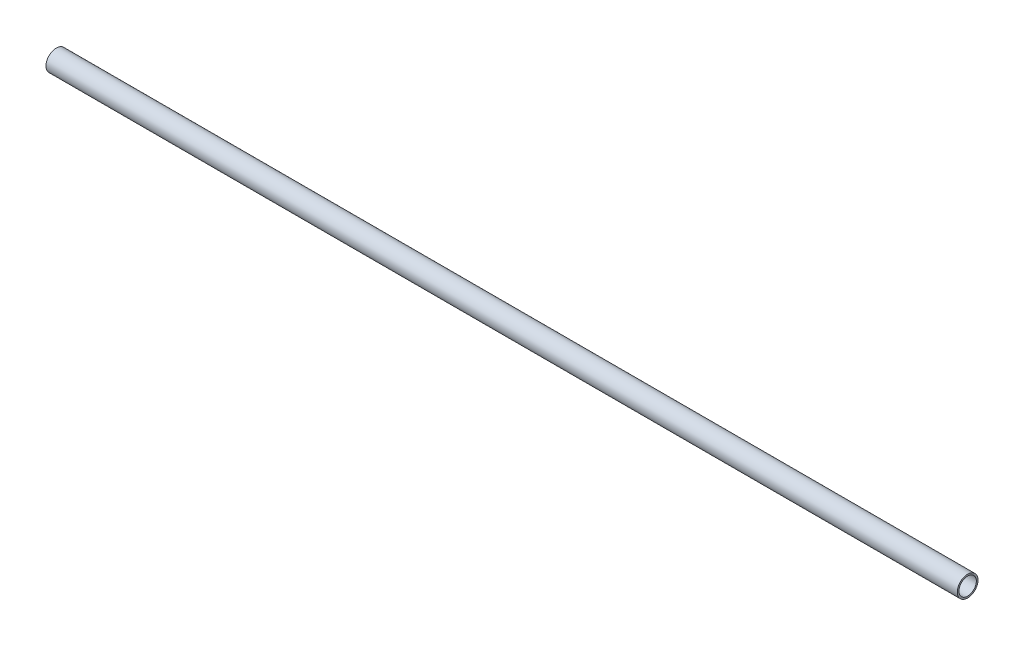
ISO-10303-21;
HEADER;
FILE_DESCRIPTION(('STEP AP214'),'2;1');
FILE_NAME('part.step','',(''),(''),'','','');
FILE_SCHEMA(('AUTOMOTIVE_DESIGN { 1 0 10303 214 1 1 1 1 }'));
ENDSEC;
DATA;
#1=APPLICATION_CONTEXT('core data for automotive mechanical design processes');
#2=APPLICATION_PROTOCOL_DEFINITION('international standard','automotive_design',2000,#1);
#3=PRODUCT_CONTEXT('',#1,'mechanical');
#4=PRODUCT('Part','Part','',(#3));
#5=PRODUCT_RELATED_PRODUCT_CATEGORY('part','',(#4));
#6=PRODUCT_DEFINITION_FORMATION('','',#4);
#7=PRODUCT_DEFINITION_CONTEXT('part definition',#1,'design');
#8=PRODUCT_DEFINITION('design','',#6,#7);
#9=PRODUCT_DEFINITION_SHAPE('','',#8);
#10=(LENGTH_UNIT() NAMED_UNIT(*) SI_UNIT(.MILLI.,.METRE.));
#11=(NAMED_UNIT(*) PLANE_ANGLE_UNIT() SI_UNIT($,.RADIAN.));
#12=(NAMED_UNIT(*) SI_UNIT($,.STERADIAN.) SOLID_ANGLE_UNIT());
#13=UNCERTAINTY_MEASURE_WITH_UNIT(LENGTH_MEASURE(1.E-05),#10,'distance_accuracy_value','');
#14=(GEOMETRIC_REPRESENTATION_CONTEXT(3) GLOBAL_UNCERTAINTY_ASSIGNED_CONTEXT((#13)) GLOBAL_UNIT_ASSIGNED_CONTEXT((#10,
#11,#12)) REPRESENTATION_CONTEXT('',''));
#15=CARTESIAN_POINT('',(0.,0.,0.));
#16=DIRECTION('',(0.,0.,1.));
#17=DIRECTION('',(1.,0.,0.));
#18=AXIS2_PLACEMENT_3D('',#15,#16,#17);
#19=CARTESIAN_POINT('',(-558.8,0.,0.));
#20=DIRECTION('',(1.,0.,0.));
#21=DIRECTION('',(0.,0.,-1.));
#22=AXIS2_PLACEMENT_3D('',#19,#20,#21);
#23=CYLINDRICAL_SURFACE('',#22,6.35);
#24=CARTESIAN_POINT('',(-558.8,0.,0.));
#25=DIRECTION('',(1.,0.,0.));
#26=DIRECTION('',(0.,0.,-1.));
#27=AXIS2_PLACEMENT_3D('',#24,#25,#26);
#28=CIRCLE('',#27,6.35);
#29=CARTESIAN_POINT('',(-558.8,0.,-6.35));
#30=VERTEX_POINT('',#29);
#31=EDGE_CURVE('E10',#30,#30,#28,.T.);
#32=ORIENTED_EDGE('',*,*,#31,.T.);
#33=EDGE_LOOP('',(#32));
#34=FACE_BOUND('',#33,.T.);
#35=CARTESIAN_POINT('',(0.,0.,0.));
#36=DIRECTION('',(1.,0.,0.));
#37=DIRECTION('',(0.,0.,-1.));
#38=AXIS2_PLACEMENT_3D('',#35,#36,#37);
#39=CIRCLE('',#38,6.35);
#40=CARTESIAN_POINT('',(0.,0.,-6.35));
#41=VERTEX_POINT('',#40);
#42=EDGE_CURVE('E34',#41,#41,#39,.T.);
#43=ORIENTED_EDGE('',*,*,#42,.F.);
#44=EDGE_LOOP('',(#43));
#45=FACE_BOUND('',#44,.T.);
#46=ADVANCED_FACE('F31',(#34,#45),#23,.T.);
#47=CARTESIAN_POINT('',(-558.8,0.,0.));
#48=DIRECTION('',(1.,0.,0.));
#49=DIRECTION('',(0.,0.,-1.));
#50=AXIS2_PLACEMENT_3D('',#47,#48,#49);
#51=PLANE('',#50);
#52=CARTESIAN_POINT('',(-558.8,0.,0.));
#53=DIRECTION('',(1.,0.,0.));
#54=DIRECTION('',(0.,0.,-1.));
#55=AXIS2_PLACEMENT_3D('',#52,#53,#54);
#56=CIRCLE('',#55,5.334);
#57=CARTESIAN_POINT('',(-558.8,0.,-5.334));
#58=VERTEX_POINT('',#57);
#59=EDGE_CURVE('E41',#58,#58,#56,.T.);
#60=ORIENTED_EDGE('',*,*,#59,.T.);
#61=EDGE_LOOP('',(#60));
#62=FACE_BOUND('',#61,.T.);
#63=ORIENTED_EDGE('',*,*,#31,.F.);
#64=EDGE_LOOP('',(#63));
#65=FACE_BOUND('',#64,.T.);
#66=ADVANCED_FACE('F49',(#62,#65),#51,.F.);
#67=CARTESIAN_POINT('',(0.,0.,0.));
#68=DIRECTION('',(1.,0.,0.));
#69=DIRECTION('',(0.,0.,-1.));
#70=AXIS2_PLACEMENT_3D('',#67,#68,#69);
#71=PLANE('',#70);
#72=CARTESIAN_POINT('',(0.,0.,0.));
#73=DIRECTION('',(1.,0.,0.));
#74=DIRECTION('',(0.,0.,-1.));
#75=AXIS2_PLACEMENT_3D('',#72,#73,#74);
#76=CIRCLE('',#75,5.334);
#77=CARTESIAN_POINT('',(0.,0.,-5.334));
#78=VERTEX_POINT('',#77);
#79=EDGE_CURVE('E43',#78,#78,#76,.T.);
#80=ORIENTED_EDGE('',*,*,#79,.F.);
#81=EDGE_LOOP('',(#80));
#82=FACE_BOUND('',#81,.T.);
#83=ORIENTED_EDGE('',*,*,#42,.T.);
#84=EDGE_LOOP('',(#83));
#85=FACE_BOUND('',#84,.T.);
#86=ADVANCED_FACE('F55',(#82,#85),#71,.T.);
#87=CARTESIAN_POINT('',(-558.8,0.,0.));
#88=DIRECTION('',(1.,0.,0.));
#89=DIRECTION('',(0.,0.,-1.));
#90=AXIS2_PLACEMENT_3D('',#87,#88,#89);
#91=CYLINDRICAL_SURFACE('',#90,5.334);
#92=ORIENTED_EDGE('',*,*,#59,.F.);
#93=EDGE_LOOP('',(#92));
#94=FACE_BOUND('',#93,.T.);
#95=ORIENTED_EDGE('',*,*,#79,.T.);
#96=EDGE_LOOP('',(#95));
#97=FACE_BOUND('',#96,.T.);
#98=ADVANCED_FACE('F52',(#94,#97),#91,.F.);
#99=CLOSED_SHELL('',(#46,#66,#86,#98));
#100=MANIFOLD_SOLID_BREP('B2',#99);
#101=ADVANCED_BREP_SHAPE_REPRESENTATION('',(#18,#100),#14);
#102=SHAPE_DEFINITION_REPRESENTATION(#9,#101);
ENDSEC;
END-ISO-10303-21;
